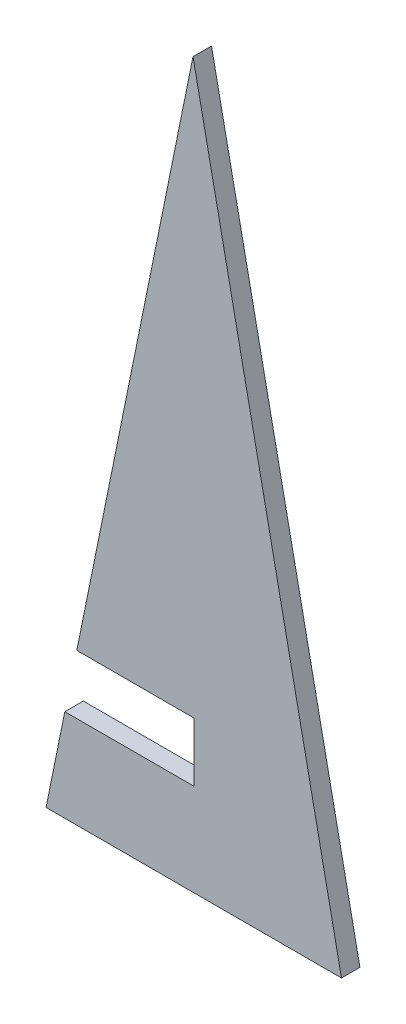
ISO-10303-21;
HEADER;
FILE_DESCRIPTION(('STEP AP214'),'2;1');
FILE_NAME('part.step','',(''),(''),'','','');
FILE_SCHEMA(('AUTOMOTIVE_DESIGN { 1 0 10303 214 1 1 1 1 }'));
ENDSEC;
DATA;
#1=APPLICATION_CONTEXT('core data for automotive mechanical design processes');
#2=APPLICATION_PROTOCOL_DEFINITION('international standard','automotive_design',2000,#1);
#3=PRODUCT_CONTEXT('',#1,'mechanical');
#4=PRODUCT('Part','Part','',(#3));
#5=PRODUCT_RELATED_PRODUCT_CATEGORY('part','',(#4));
#6=PRODUCT_DEFINITION_FORMATION('','',#4);
#7=PRODUCT_DEFINITION_CONTEXT('part definition',#1,'design');
#8=PRODUCT_DEFINITION('design','',#6,#7);
#9=PRODUCT_DEFINITION_SHAPE('','',#8);
#10=(LENGTH_UNIT() NAMED_UNIT(*) SI_UNIT(.MILLI.,.METRE.));
#11=(NAMED_UNIT(*) PLANE_ANGLE_UNIT() SI_UNIT($,.RADIAN.));
#12=(NAMED_UNIT(*) SI_UNIT($,.STERADIAN.) SOLID_ANGLE_UNIT());
#13=UNCERTAINTY_MEASURE_WITH_UNIT(LENGTH_MEASURE(1.E-05),#10,'distance_accuracy_value','');
#14=(GEOMETRIC_REPRESENTATION_CONTEXT(3) GLOBAL_UNCERTAINTY_ASSIGNED_CONTEXT((#13)) GLOBAL_UNIT_ASSIGNED_CONTEXT((#10,
#11,#12)) REPRESENTATION_CONTEXT('',''));
#15=CARTESIAN_POINT('',(0.,0.,0.));
#16=DIRECTION('',(0.,0.,1.));
#17=DIRECTION('',(1.,0.,0.));
#18=AXIS2_PLACEMENT_3D('',#15,#16,#17);
#19=CARTESIAN_POINT('',(0.,0.,10.));
#20=DIRECTION('',(-0.98,0.198997487421324,0.));
#21=DIRECTION('',(-0.198997487421324,-0.98,0.));
#22=AXIS2_PLACEMENT_3D('',#19,#20,#21);
#23=PLANE('',#22);
#24=DIRECTION('',(0.,0.,1.));
#25=VECTOR('',#24,1.);
#26=CARTESIAN_POINT('',(10.1529330317002,50.,0.));
#27=LINE('',#26,#25);
#28=CARTESIAN_POINT('',(10.1529330317002,50.,0.));
#29=VERTEX_POINT('',#28);
#30=CARTESIAN_POINT('',(10.1529330317002,50.,10.));
#31=VERTEX_POINT('',#30);
#32=EDGE_CURVE('E149',#29,#31,#27,.T.);
#33=ORIENTED_EDGE('',*,*,#32,.F.);
#34=DIRECTION('',(-0.198997487421324,-0.98,0.));
#35=VECTOR('',#34,1.);
#36=CARTESIAN_POINT('',(0.,0.,0.));
#37=LINE('',#36,#35);
#38=CARTESIAN_POINT('',(0.,0.,0.));
#39=VERTEX_POINT('',#38);
#40=EDGE_CURVE('E129',#29,#39,#37,.T.);
#41=ORIENTED_EDGE('',*,*,#40,.T.);
#42=DIRECTION('',(0.,0.,-1.));
#43=VECTOR('',#42,1.);
#44=CARTESIAN_POINT('',(0.,0.,10.));
#45=LINE('',#44,#43);
#46=CARTESIAN_POINT('',(0.,0.,10.));
#47=VERTEX_POINT('',#46);
#48=EDGE_CURVE('E11',#47,#39,#45,.T.);
#49=ORIENTED_EDGE('',*,*,#48,.F.);
#50=DIRECTION('',(-0.198997487421324,-0.98,0.));
#51=VECTOR('',#50,1.);
#52=CARTESIAN_POINT('',(0.,0.,10.));
#53=LINE('',#52,#51);
#54=EDGE_CURVE('E144',#31,#47,#53,.T.);
#55=ORIENTED_EDGE('',*,*,#54,.F.);
#56=EDGE_LOOP('',(#33,#41,#49,#55));
#57=FACE_BOUND('',#56,.T.);
#58=ADVANCED_FACE('F43',(#57),#23,.T.);
#59=CARTESIAN_POINT('',(160.,0.,10.));
#60=DIRECTION('',(0.,-1.,0.));
#61=DIRECTION('',(1.,0.,0.));
#62=AXIS2_PLACEMENT_3D('',#59,#60,#61);
#63=PLANE('',#62);
#64=DIRECTION('',(1.,0.,0.));
#65=VECTOR('',#64,1.);
#66=CARTESIAN_POINT('',(160.,0.,0.));
#67=LINE('',#66,#65);
#68=CARTESIAN_POINT('',(160.,0.,0.));
#69=VERTEX_POINT('',#68);
#70=EDGE_CURVE('E86',#39,#69,#67,.T.);
#71=ORIENTED_EDGE('',*,*,#70,.T.);
#72=DIRECTION('',(0.,0.,-1.));
#73=VECTOR('',#72,1.);
#74=CARTESIAN_POINT('',(160.,0.,10.));
#75=LINE('',#74,#73);
#76=CARTESIAN_POINT('',(160.,0.,10.));
#77=VERTEX_POINT('',#76);
#78=EDGE_CURVE('E47',#77,#69,#75,.T.);
#79=ORIENTED_EDGE('',*,*,#78,.F.);
#80=DIRECTION('',(1.,0.,0.));
#81=VECTOR('',#80,1.);
#82=CARTESIAN_POINT('',(160.,0.,10.));
#83=LINE('',#82,#81);
#84=EDGE_CURVE('E68',#47,#77,#83,.T.);
#85=ORIENTED_EDGE('',*,*,#84,.F.);
#86=ORIENTED_EDGE('',*,*,#48,.T.);
#87=EDGE_LOOP('',(#71,#79,#85,#86));
#88=FACE_BOUND('',#87,.T.);
#89=ADVANCED_FACE('F45',(#88),#63,.T.);
#90=DIRECTION('',(0.,0.,1.));
#91=VECTOR('',#90,1.);
#92=CARTESIAN_POINT('',(16.6508101719883,82.,0.));
#93=LINE('',#92,#91);
#94=CARTESIAN_POINT('',(16.6508101719883,82.,0.));
#95=VERTEX_POINT('',#94);
#96=CARTESIAN_POINT('',(16.6508101719883,82.,10.));
#97=VERTEX_POINT('',#96);
#98=EDGE_CURVE('E128',#95,#97,#93,.T.);
#99=ORIENTED_EDGE('',*,*,#98,.T.);
#100=CARTESIAN_POINT('',(79.5989949685296,392.,10.));
#101=VERTEX_POINT('',#100);
#102=EDGE_CURVE('E145',#101,#97,#53,.T.);
#103=ORIENTED_EDGE('',*,*,#102,.F.);
#104=DIRECTION('',(0.,0.,-1.));
#105=VECTOR('',#104,1.);
#106=CARTESIAN_POINT('',(79.5989949685296,392.,10.));
#107=LINE('',#106,#105);
#108=CARTESIAN_POINT('',(79.5989949685296,392.,0.));
#109=VERTEX_POINT('',#108);
#110=EDGE_CURVE('E52',#101,#109,#107,.T.);
#111=ORIENTED_EDGE('',*,*,#110,.T.);
#112=EDGE_CURVE('E116',#109,#95,#37,.T.);
#113=ORIENTED_EDGE('',*,*,#112,.T.);
#114=EDGE_LOOP('',(#99,#103,#111,#113));
#115=FACE_BOUND('',#114,.T.);
#116=ADVANCED_FACE('F126',(#115),#23,.T.);
#117=CARTESIAN_POINT('',(79.5989949685296,392.,10.));
#118=DIRECTION('',(0.979607251294687,0.200921958010737,0.));
#119=DIRECTION('',(-0.200921958010737,0.979607251294687,0.));
#120=AXIS2_PLACEMENT_3D('',#117,#118,#119);
#121=PLANE('',#120);
#122=DIRECTION('',(-0.200921958010737,0.979607251294687,0.));
#123=VECTOR('',#122,1.);
#124=CARTESIAN_POINT('',(79.5989949685296,392.,0.));
#125=LINE('',#124,#123);
#126=EDGE_CURVE('E148',#69,#109,#125,.T.);
#127=ORIENTED_EDGE('',*,*,#126,.T.);
#128=ORIENTED_EDGE('',*,*,#110,.F.);
#129=DIRECTION('',(-0.200921958010737,0.979607251294687,0.));
#130=VECTOR('',#129,1.);
#131=CARTESIAN_POINT('',(79.5989949685296,392.,10.));
#132=LINE('',#131,#130);
#133=EDGE_CURVE('E91',#77,#101,#132,.T.);
#134=ORIENTED_EDGE('',*,*,#133,.F.);
#135=ORIENTED_EDGE('',*,*,#78,.T.);
#136=EDGE_LOOP('',(#127,#128,#134,#135));
#137=FACE_BOUND('',#136,.T.);
#138=ADVANCED_FACE('F150',(#137),#121,.T.);
#139=CARTESIAN_POINT('',(0.,0.,10.));
#140=DIRECTION('',(0.,0.,1.));
#141=DIRECTION('',(-1.,0.,0.));
#142=AXIS2_PLACEMENT_3D('',#139,#140,#141);
#143=PLANE('',#142);
#144=DIRECTION('',(-1.,0.,0.));
#145=VECTOR('',#144,1.);
#146=CARTESIAN_POINT('',(10.1529330317002,50.,10.));
#147=LINE('',#146,#145);
#148=CARTESIAN_POINT('',(80.1529330317002,50.,10.));
#149=VERTEX_POINT('',#148);
#150=EDGE_CURVE('E122',#149,#31,#147,.T.);
#151=ORIENTED_EDGE('',*,*,#150,.T.);
#152=ORIENTED_EDGE('',*,*,#54,.T.);
#153=ORIENTED_EDGE('',*,*,#84,.T.);
#154=ORIENTED_EDGE('',*,*,#133,.T.);
#155=ORIENTED_EDGE('',*,*,#102,.T.);
#156=DIRECTION('',(1.,0.,0.));
#157=VECTOR('',#156,1.);
#158=CARTESIAN_POINT('',(80.1529330317002,82.,10.));
#159=LINE('',#158,#157);
#160=CARTESIAN_POINT('',(80.1529330317002,82.,10.));
#161=VERTEX_POINT('',#160);
#162=EDGE_CURVE('E133',#97,#161,#159,.T.);
#163=ORIENTED_EDGE('',*,*,#162,.T.);
#164=DIRECTION('',(0.,-1.,0.));
#165=VECTOR('',#164,1.);
#166=CARTESIAN_POINT('',(80.1529330317002,50.,10.));
#167=LINE('',#166,#165);
#168=EDGE_CURVE('E163',#161,#149,#167,.T.);
#169=ORIENTED_EDGE('',*,*,#168,.T.);
#170=EDGE_LOOP('',(#151,#152,#153,#154,#155,#163,#169));
#171=FACE_BOUND('',#170,.T.);
#172=ADVANCED_FACE('F169',(#171),#143,.T.);
#173=CARTESIAN_POINT('',(0.,0.,0.));
#174=DIRECTION('',(0.,0.,1.));
#175=DIRECTION('',(-1.,0.,0.));
#176=AXIS2_PLACEMENT_3D('',#173,#174,#175);
#177=PLANE('',#176);
#178=DIRECTION('',(0.,-1.,0.));
#179=VECTOR('',#178,1.);
#180=CARTESIAN_POINT('',(80.1529330317002,50.,0.));
#181=LINE('',#180,#179);
#182=CARTESIAN_POINT('',(80.1529330317002,82.,0.));
#183=VERTEX_POINT('',#182);
#184=CARTESIAN_POINT('',(80.1529330317002,50.,0.));
#185=VERTEX_POINT('',#184);
#186=EDGE_CURVE('E119',#183,#185,#181,.T.);
#187=ORIENTED_EDGE('',*,*,#186,.F.);
#188=DIRECTION('',(1.,0.,0.));
#189=VECTOR('',#188,1.);
#190=CARTESIAN_POINT('',(80.1529330317002,82.,0.));
#191=LINE('',#190,#189);
#192=EDGE_CURVE('E113',#95,#183,#191,.T.);
#193=ORIENTED_EDGE('',*,*,#192,.F.);
#194=ORIENTED_EDGE('',*,*,#112,.F.);
#195=ORIENTED_EDGE('',*,*,#126,.F.);
#196=ORIENTED_EDGE('',*,*,#70,.F.);
#197=ORIENTED_EDGE('',*,*,#40,.F.);
#198=DIRECTION('',(-1.,0.,0.));
#199=VECTOR('',#198,1.);
#200=CARTESIAN_POINT('',(10.1529330317002,50.,0.));
#201=LINE('',#200,#199);
#202=EDGE_CURVE('E135',#185,#29,#201,.T.);
#203=ORIENTED_EDGE('',*,*,#202,.F.);
#204=EDGE_LOOP('',(#187,#193,#194,#195,#196,#197,#203));
#205=FACE_BOUND('',#204,.T.);
#206=ADVANCED_FACE('F115',(#205),#177,.F.);
#207=CARTESIAN_POINT('',(10.1529330317002,50.,0.));
#208=DIRECTION('',(0.,-1.,0.));
#209=DIRECTION('',(1.,0.,0.));
#210=AXIS2_PLACEMENT_3D('',#207,#208,#209);
#211=PLANE('',#210);
#212=ORIENTED_EDGE('',*,*,#150,.F.);
#213=DIRECTION('',(0.,0.,1.));
#214=VECTOR('',#213,1.);
#215=CARTESIAN_POINT('',(80.1529330317002,50.,0.));
#216=LINE('',#215,#214);
#217=EDGE_CURVE('E137',#185,#149,#216,.T.);
#218=ORIENTED_EDGE('',*,*,#217,.F.);
#219=ORIENTED_EDGE('',*,*,#202,.T.);
#220=ORIENTED_EDGE('',*,*,#32,.T.);
#221=EDGE_LOOP('',(#212,#218,#219,#220));
#222=FACE_BOUND('',#221,.T.);
#223=ADVANCED_FACE('F167',(#222),#211,.F.);
#224=CARTESIAN_POINT('',(80.1529330317002,50.,0.));
#225=DIRECTION('',(1.,0.,0.));
#226=DIRECTION('',(0.,0.,1.));
#227=AXIS2_PLACEMENT_3D('',#224,#225,#226);
#228=PLANE('',#227);
#229=ORIENTED_EDGE('',*,*,#168,.F.);
#230=DIRECTION('',(0.,0.,1.));
#231=VECTOR('',#230,1.);
#232=CARTESIAN_POINT('',(80.1529330317002,82.,0.));
#233=LINE('',#232,#231);
#234=EDGE_CURVE('E60',#183,#161,#233,.T.);
#235=ORIENTED_EDGE('',*,*,#234,.F.);
#236=ORIENTED_EDGE('',*,*,#186,.T.);
#237=ORIENTED_EDGE('',*,*,#217,.T.);
#238=EDGE_LOOP('',(#229,#235,#236,#237));
#239=FACE_BOUND('',#238,.T.);
#240=ADVANCED_FACE('F158',(#239),#228,.F.);
#241=CARTESIAN_POINT('',(80.1529330317002,82.,0.));
#242=DIRECTION('',(0.,1.,0.));
#243=DIRECTION('',(-1.,0.,0.));
#244=AXIS2_PLACEMENT_3D('',#241,#242,#243);
#245=PLANE('',#244);
#246=ORIENTED_EDGE('',*,*,#162,.F.);
#247=ORIENTED_EDGE('',*,*,#98,.F.);
#248=ORIENTED_EDGE('',*,*,#192,.T.);
#249=ORIENTED_EDGE('',*,*,#234,.T.);
#250=EDGE_LOOP('',(#246,#247,#248,#249));
#251=FACE_BOUND('',#250,.T.);
#252=ADVANCED_FACE('F131',(#251),#245,.F.);
#253=CLOSED_SHELL('',(#58,#89,#116,#138,#172,#206,#223,#240,#252));
#254=MANIFOLD_SOLID_BREP('B2',#253);
#255=ADVANCED_BREP_SHAPE_REPRESENTATION('',(#18,#254),#14);
#256=SHAPE_DEFINITION_REPRESENTATION(#9,#255);
ENDSEC;
END-ISO-10303-21;
